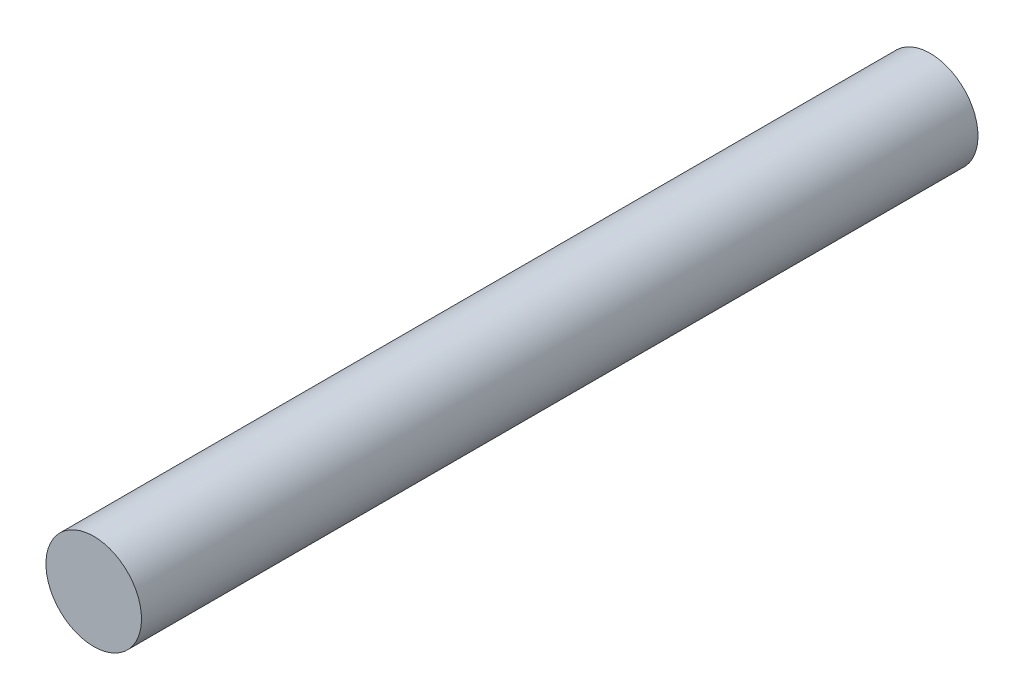
ISO-10303-21;
HEADER;
FILE_DESCRIPTION(('STEP AP214'),'2;1');
FILE_NAME('part.step','',(''),(''),'','','');
FILE_SCHEMA(('AUTOMOTIVE_DESIGN { 1 0 10303 214 1 1 1 1 }'));
ENDSEC;
DATA;
#1=APPLICATION_CONTEXT('core data for automotive mechanical design processes');
#2=APPLICATION_PROTOCOL_DEFINITION('international standard','automotive_design',2000,#1);
#3=PRODUCT_CONTEXT('',#1,'mechanical');
#4=PRODUCT('Part','Part','',(#3));
#5=PRODUCT_RELATED_PRODUCT_CATEGORY('part','',(#4));
#6=PRODUCT_DEFINITION_FORMATION('','',#4);
#7=PRODUCT_DEFINITION_CONTEXT('part definition',#1,'design');
#8=PRODUCT_DEFINITION('design','',#6,#7);
#9=PRODUCT_DEFINITION_SHAPE('','',#8);
#10=(LENGTH_UNIT() NAMED_UNIT(*) SI_UNIT(.MILLI.,.METRE.));
#11=(NAMED_UNIT(*) PLANE_ANGLE_UNIT() SI_UNIT($,.RADIAN.));
#12=(NAMED_UNIT(*) SI_UNIT($,.STERADIAN.) SOLID_ANGLE_UNIT());
#13=UNCERTAINTY_MEASURE_WITH_UNIT(LENGTH_MEASURE(1.E-05),#10,'distance_accuracy_value','');
#14=(GEOMETRIC_REPRESENTATION_CONTEXT(3) GLOBAL_UNCERTAINTY_ASSIGNED_CONTEXT((#13)) GLOBAL_UNIT_ASSIGNED_CONTEXT((#10,
#11,#12)) REPRESENTATION_CONTEXT('',''));
#15=CARTESIAN_POINT('',(0.,0.,0.));
#16=DIRECTION('',(0.,0.,1.));
#17=DIRECTION('',(1.,0.,0.));
#18=AXIS2_PLACEMENT_3D('',#15,#16,#17);
#19=CARTESIAN_POINT('',(0.,0.,35.));
#20=DIRECTION('',(0.,0.,-1.));
#21=DIRECTION('',(-1.,0.,0.));
#22=AXIS2_PLACEMENT_3D('',#19,#20,#21);
#23=CYLINDRICAL_SURFACE('',#22,2.);
#24=CARTESIAN_POINT('',(0.,0.,35.));
#25=DIRECTION('',(0.,0.,1.));
#26=DIRECTION('',(1.,0.,0.));
#27=AXIS2_PLACEMENT_3D('',#24,#25,#26);
#28=CIRCLE('',#27,2.);
#29=CARTESIAN_POINT('',(2.,0.,35.));
#30=VERTEX_POINT('',#29);
#31=EDGE_CURVE('E10',#30,#30,#28,.T.);
#32=ORIENTED_EDGE('',*,*,#31,.F.);
#33=EDGE_LOOP('',(#32));
#34=FACE_BOUND('',#33,.T.);
#35=CARTESIAN_POINT('',(0.,0.,0.));
#36=DIRECTION('',(0.,0.,1.));
#37=DIRECTION('',(1.,0.,0.));
#38=AXIS2_PLACEMENT_3D('',#35,#36,#37);
#39=CIRCLE('',#38,2.);
#40=CARTESIAN_POINT('',(2.,0.,0.));
#41=VERTEX_POINT('',#40);
#42=EDGE_CURVE('E33',#41,#41,#39,.T.);
#43=ORIENTED_EDGE('',*,*,#42,.T.);
#44=EDGE_LOOP('',(#43));
#45=FACE_BOUND('',#44,.T.);
#46=ADVANCED_FACE('F30',(#34,#45),#23,.T.);
#47=CARTESIAN_POINT('',(0.,0.,35.));
#48=DIRECTION('',(0.,0.,1.));
#49=DIRECTION('',(1.,0.,0.));
#50=AXIS2_PLACEMENT_3D('',#47,#48,#49);
#51=PLANE('',#50);
#52=ORIENTED_EDGE('',*,*,#31,.T.);
#53=EDGE_LOOP('',(#52));
#54=FACE_BOUND('',#53,.T.);
#55=ADVANCED_FACE('F45',(#54),#51,.T.);
#56=CARTESIAN_POINT('',(0.,0.,0.));
#57=DIRECTION('',(0.,0.,1.));
#58=DIRECTION('',(1.,0.,0.));
#59=AXIS2_PLACEMENT_3D('',#56,#57,#58);
#60=PLANE('',#59);
#61=ORIENTED_EDGE('',*,*,#42,.F.);
#62=EDGE_LOOP('',(#61));
#63=FACE_BOUND('',#62,.T.);
#64=ADVANCED_FACE('F43',(#63),#60,.F.);
#65=CLOSED_SHELL('',(#46,#55,#64));
#66=MANIFOLD_SOLID_BREP('B2',#65);
#67=ADVANCED_BREP_SHAPE_REPRESENTATION('',(#18,#66),#14);
#68=SHAPE_DEFINITION_REPRESENTATION(#9,#67);
ENDSEC;
END-ISO-10303-21;
